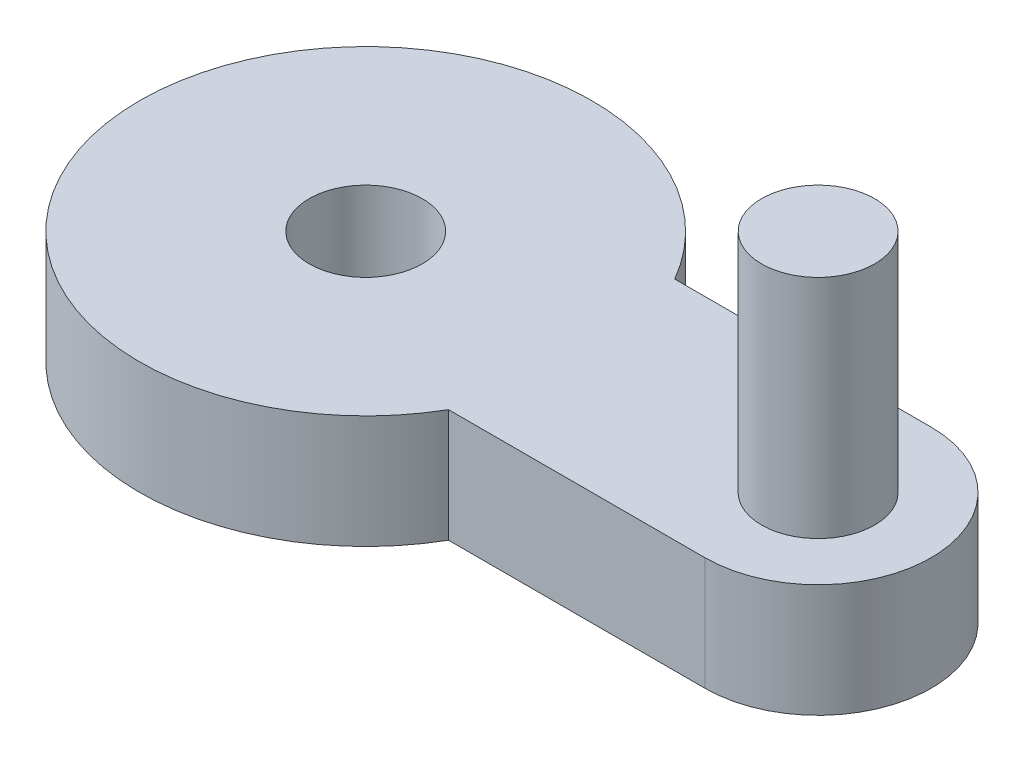
ISO-10303-21;
HEADER;
FILE_DESCRIPTION(('STEP AP214'),'2;1');
FILE_NAME('part.step','',(''),(''),'','','');
FILE_SCHEMA(('AUTOMOTIVE_DESIGN { 1 0 10303 214 1 1 1 1 }'));
ENDSEC;
DATA;
#1=APPLICATION_CONTEXT('core data for automotive mechanical design processes');
#2=APPLICATION_PROTOCOL_DEFINITION('international standard','automotive_design',2000,#1);
#3=PRODUCT_CONTEXT('',#1,'mechanical');
#4=PRODUCT('Part','Part','',(#3));
#5=PRODUCT_RELATED_PRODUCT_CATEGORY('part','',(#4));
#6=PRODUCT_DEFINITION_FORMATION('','',#4);
#7=PRODUCT_DEFINITION_CONTEXT('part definition',#1,'design');
#8=PRODUCT_DEFINITION('design','',#6,#7);
#9=PRODUCT_DEFINITION_SHAPE('','',#8);
#10=(LENGTH_UNIT() NAMED_UNIT(*) SI_UNIT(.MILLI.,.METRE.));
#11=(NAMED_UNIT(*) PLANE_ANGLE_UNIT() SI_UNIT($,.RADIAN.));
#12=(NAMED_UNIT(*) SI_UNIT($,.STERADIAN.) SOLID_ANGLE_UNIT());
#13=UNCERTAINTY_MEASURE_WITH_UNIT(LENGTH_MEASURE(1.E-05),#10,'distance_accuracy_value','');
#14=(GEOMETRIC_REPRESENTATION_CONTEXT(3) GLOBAL_UNCERTAINTY_ASSIGNED_CONTEXT((#13)) GLOBAL_UNIT_ASSIGNED_CONTEXT((#10,
#11,#12)) REPRESENTATION_CONTEXT('',''));
#15=CARTESIAN_POINT('',(0.,0.,0.));
#16=DIRECTION('',(0.,0.,1.));
#17=DIRECTION('',(1.,0.,0.));
#18=AXIS2_PLACEMENT_3D('',#15,#16,#17);
#19=CARTESIAN_POINT('',(0.,5.,0.));
#20=DIRECTION('',(0.,1.,0.));
#21=DIRECTION('',(0.,0.,1.));
#22=AXIS2_PLACEMENT_3D('',#19,#20,#21);
#23=PLANE('',#22);
#24=CARTESIAN_POINT('',(20.,5.,0.));
#25=DIRECTION('',(0.,1.,0.));
#26=DIRECTION('',(0.,0.,1.));
#27=AXIS2_PLACEMENT_3D('',#24,#25,#26);
#28=CIRCLE('',#27,2.49999999999999);
#29=CARTESIAN_POINT('',(20.,5.,2.5));
#30=VERTEX_POINT('',#29);
#31=EDGE_CURVE('E119',#30,#30,#28,.T.);
#32=ORIENTED_EDGE('',*,*,#31,.F.);
#33=EDGE_LOOP('',(#32));
#34=FACE_BOUND('',#33,.T.);
#35=CARTESIAN_POINT('',(0.,5.,0.));
#36=DIRECTION('',(0.,1.,0.));
#37=DIRECTION('',(0.,0.,1.));
#38=AXIS2_PLACEMENT_3D('',#35,#36,#37);
#39=CIRCLE('',#38,10.);
#40=CARTESIAN_POINT('',(8.66025403784439,5.,-5.));
#41=VERTEX_POINT('',#40);
#42=CARTESIAN_POINT('',(8.66025403784439,5.,5.));
#43=VERTEX_POINT('',#42);
#44=EDGE_CURVE('E86',#41,#43,#39,.T.);
#45=ORIENTED_EDGE('',*,*,#44,.T.);
#46=DIRECTION('',(1.,0.,0.));
#47=VECTOR('',#46,1.);
#48=CARTESIAN_POINT('',(20.,5.,5.));
#49=LINE('',#48,#47);
#50=CARTESIAN_POINT('',(20.,5.,5.));
#51=VERTEX_POINT('',#50);
#52=EDGE_CURVE('E81',#43,#51,#49,.T.);
#53=ORIENTED_EDGE('',*,*,#52,.T.);
#54=CARTESIAN_POINT('',(20.,5.,0.));
#55=DIRECTION('',(0.,1.,0.));
#56=DIRECTION('',(0.,0.,-1.));
#57=AXIS2_PLACEMENT_3D('',#54,#55,#56);
#58=CIRCLE('',#57,5.);
#59=CARTESIAN_POINT('',(20.,5.,-4.99999999999999));
#60=VERTEX_POINT('',#59);
#61=EDGE_CURVE('E84',#51,#60,#58,.T.);
#62=ORIENTED_EDGE('',*,*,#61,.T.);
#63=DIRECTION('',(-1.,0.,0.));
#64=VECTOR('',#63,1.);
#65=CARTESIAN_POINT('',(8.66025403784439,5.,-5.));
#66=LINE('',#65,#64);
#67=EDGE_CURVE('E51',#60,#41,#66,.T.);
#68=ORIENTED_EDGE('',*,*,#67,.T.);
#69=EDGE_LOOP('',(#45,#53,#62,#68));
#70=FACE_BOUND('',#69,.T.);
#71=CARTESIAN_POINT('',(0.,5.,0.));
#72=DIRECTION('',(0.,1.,0.));
#73=DIRECTION('',(0.,0.,1.));
#74=AXIS2_PLACEMENT_3D('',#71,#72,#73);
#75=CIRCLE('',#74,2.5);
#76=CARTESIAN_POINT('',(0.,5.,2.5));
#77=VERTEX_POINT('',#76);
#78=EDGE_CURVE('E101',#77,#77,#75,.T.);
#79=ORIENTED_EDGE('',*,*,#78,.F.);
#80=EDGE_LOOP('',(#79));
#81=FACE_BOUND('',#80,.T.);
#82=ADVANCED_FACE('F34',(#34,#70,#81),#23,.T.);
#83=CARTESIAN_POINT('',(0.,0.,0.));
#84=DIRECTION('',(0.,1.,0.));
#85=DIRECTION('',(0.,0.,1.));
#86=AXIS2_PLACEMENT_3D('',#83,#84,#85);
#87=PLANE('',#86);
#88=CARTESIAN_POINT('',(0.,0.,0.));
#89=DIRECTION('',(0.,1.,0.));
#90=DIRECTION('',(0.,0.,1.));
#91=AXIS2_PLACEMENT_3D('',#88,#89,#90);
#92=CIRCLE('',#91,10.);
#93=CARTESIAN_POINT('',(8.66025403784439,0.,-5.));
#94=VERTEX_POINT('',#93);
#95=CARTESIAN_POINT('',(8.66025403784439,0.,5.));
#96=VERTEX_POINT('',#95);
#97=EDGE_CURVE('E98',#94,#96,#92,.T.);
#98=ORIENTED_EDGE('',*,*,#97,.F.);
#99=DIRECTION('',(-1.,0.,0.));
#100=VECTOR('',#99,1.);
#101=CARTESIAN_POINT('',(8.66025403784439,0.,-5.));
#102=LINE('',#101,#100);
#103=CARTESIAN_POINT('',(20.,0.,-4.99999999999999));
#104=VERTEX_POINT('',#103);
#105=EDGE_CURVE('E74',#104,#94,#102,.T.);
#106=ORIENTED_EDGE('',*,*,#105,.F.);
#107=CARTESIAN_POINT('',(20.,0.,0.));
#108=DIRECTION('',(0.,1.,0.));
#109=DIRECTION('',(0.,0.,-1.));
#110=AXIS2_PLACEMENT_3D('',#107,#108,#109);
#111=CIRCLE('',#110,5.);
#112=CARTESIAN_POINT('',(20.,0.,5.));
#113=VERTEX_POINT('',#112);
#114=EDGE_CURVE('E68',#113,#104,#111,.T.);
#115=ORIENTED_EDGE('',*,*,#114,.F.);
#116=DIRECTION('',(1.,0.,0.));
#117=VECTOR('',#116,1.);
#118=CARTESIAN_POINT('',(20.,0.,5.));
#119=LINE('',#118,#117);
#120=EDGE_CURVE('E90',#96,#113,#119,.T.);
#121=ORIENTED_EDGE('',*,*,#120,.F.);
#122=EDGE_LOOP('',(#98,#106,#115,#121));
#123=FACE_BOUND('',#122,.T.);
#124=CARTESIAN_POINT('',(0.,0.,0.));
#125=DIRECTION('',(0.,1.,0.));
#126=DIRECTION('',(0.,0.,1.));
#127=AXIS2_PLACEMENT_3D('',#124,#125,#126);
#128=CIRCLE('',#127,2.5);
#129=CARTESIAN_POINT('',(0.,0.,2.5));
#130=VERTEX_POINT('',#129);
#131=EDGE_CURVE('E113',#130,#130,#128,.T.);
#132=ORIENTED_EDGE('',*,*,#131,.T.);
#133=EDGE_LOOP('',(#132));
#134=FACE_BOUND('',#133,.T.);
#135=ADVANCED_FACE('F109',(#123,#134),#87,.F.);
#136=CARTESIAN_POINT('',(0.,5.,0.));
#137=DIRECTION('',(0.,-1.,0.));
#138=DIRECTION('',(0.,0.,-1.));
#139=AXIS2_PLACEMENT_3D('',#136,#137,#138);
#140=CYLINDRICAL_SURFACE('',#139,10.);
#141=ORIENTED_EDGE('',*,*,#97,.T.);
#142=DIRECTION('',(0.,-1.,0.));
#143=VECTOR('',#142,1.);
#144=CARTESIAN_POINT('',(8.66025403784439,5.,5.));
#145=LINE('',#144,#143);
#146=EDGE_CURVE('E11',#43,#96,#145,.T.);
#147=ORIENTED_EDGE('',*,*,#146,.F.);
#148=ORIENTED_EDGE('',*,*,#44,.F.);
#149=DIRECTION('',(0.,-1.,0.));
#150=VECTOR('',#149,1.);
#151=CARTESIAN_POINT('',(8.66025403784439,5.,-5.));
#152=LINE('',#151,#150);
#153=EDGE_CURVE('E94',#41,#94,#152,.T.);
#154=ORIENTED_EDGE('',*,*,#153,.T.);
#155=EDGE_LOOP('',(#141,#147,#148,#154));
#156=FACE_BOUND('',#155,.T.);
#157=ADVANCED_FACE('F36',(#156),#140,.T.);
#158=CARTESIAN_POINT('',(20.,5.,5.));
#159=DIRECTION('',(0.,0.,-1.));
#160=DIRECTION('',(-1.,0.,0.));
#161=AXIS2_PLACEMENT_3D('',#158,#159,#160);
#162=PLANE('',#161);
#163=ORIENTED_EDGE('',*,*,#120,.T.);
#164=DIRECTION('',(0.,-1.,0.));
#165=VECTOR('',#164,1.);
#166=CARTESIAN_POINT('',(20.,5.,5.));
#167=LINE('',#166,#165);
#168=EDGE_CURVE('E43',#51,#113,#167,.T.);
#169=ORIENTED_EDGE('',*,*,#168,.F.);
#170=ORIENTED_EDGE('',*,*,#52,.F.);
#171=ORIENTED_EDGE('',*,*,#146,.T.);
#172=EDGE_LOOP('',(#163,#169,#170,#171));
#173=FACE_BOUND('',#172,.T.);
#174=ADVANCED_FACE('F89',(#173),#162,.F.);
#175=CARTESIAN_POINT('',(20.,5.,0.));
#176=DIRECTION('',(0.,-1.,0.));
#177=DIRECTION('',(0.,0.,-1.));
#178=AXIS2_PLACEMENT_3D('',#175,#176,#177);
#179=CYLINDRICAL_SURFACE('',#178,5.);
#180=ORIENTED_EDGE('',*,*,#114,.T.);
#181=DIRECTION('',(0.,-1.,0.));
#182=VECTOR('',#181,1.);
#183=CARTESIAN_POINT('',(20.,5.,-4.99999999999999));
#184=LINE('',#183,#182);
#185=EDGE_CURVE('E91',#60,#104,#184,.T.);
#186=ORIENTED_EDGE('',*,*,#185,.F.);
#187=ORIENTED_EDGE('',*,*,#61,.F.);
#188=ORIENTED_EDGE('',*,*,#168,.T.);
#189=EDGE_LOOP('',(#180,#186,#187,#188));
#190=FACE_BOUND('',#189,.T.);
#191=ADVANCED_FACE('F92',(#190),#179,.T.);
#192=CARTESIAN_POINT('',(8.66025403784439,5.,-5.));
#193=DIRECTION('',(0.,0.,1.));
#194=DIRECTION('',(1.,0.,0.));
#195=AXIS2_PLACEMENT_3D('',#192,#193,#194);
#196=PLANE('',#195);
#197=ORIENTED_EDGE('',*,*,#105,.T.);
#198=ORIENTED_EDGE('',*,*,#153,.F.);
#199=ORIENTED_EDGE('',*,*,#67,.F.);
#200=ORIENTED_EDGE('',*,*,#185,.T.);
#201=EDGE_LOOP('',(#197,#198,#199,#200));
#202=FACE_BOUND('',#201,.T.);
#203=ADVANCED_FACE('F106',(#202),#196,.F.);
#204=CARTESIAN_POINT('',(0.,5.,0.));
#205=DIRECTION('',(0.,-1.,0.));
#206=DIRECTION('',(0.,0.,-1.));
#207=AXIS2_PLACEMENT_3D('',#204,#205,#206);
#208=CYLINDRICAL_SURFACE('',#207,2.5);
#209=ORIENTED_EDGE('',*,*,#78,.T.);
#210=EDGE_LOOP('',(#209));
#211=FACE_BOUND('',#210,.T.);
#212=ORIENTED_EDGE('',*,*,#131,.F.);
#213=EDGE_LOOP('',(#212));
#214=FACE_BOUND('',#213,.T.);
#215=ADVANCED_FACE('F130',(#211,#214),#208,.F.);
#216=CARTESIAN_POINT('',(20.,15.,0.));
#217=DIRECTION('',(0.,-1.,0.));
#218=DIRECTION('',(0.,0.,-1.));
#219=AXIS2_PLACEMENT_3D('',#216,#217,#218);
#220=CYLINDRICAL_SURFACE('',#219,2.49999999999999);
#221=CARTESIAN_POINT('',(20.,15.,0.));
#222=DIRECTION('',(0.,1.,0.));
#223=DIRECTION('',(0.,0.,1.));
#224=AXIS2_PLACEMENT_3D('',#221,#222,#223);
#225=CIRCLE('',#224,2.49999999999999);
#226=CARTESIAN_POINT('',(20.,15.,2.5));
#227=VERTEX_POINT('',#226);
#228=EDGE_CURVE('E116',#227,#227,#225,.T.);
#229=ORIENTED_EDGE('',*,*,#228,.F.);
#230=EDGE_LOOP('',(#229));
#231=FACE_BOUND('',#230,.T.);
#232=ORIENTED_EDGE('',*,*,#31,.T.);
#233=EDGE_LOOP('',(#232));
#234=FACE_BOUND('',#233,.T.);
#235=ADVANCED_FACE('F127',(#231,#234),#220,.T.);
#236=CARTESIAN_POINT('',(20.,15.,0.));
#237=DIRECTION('',(0.,1.,0.));
#238=DIRECTION('',(0.,0.,1.));
#239=AXIS2_PLACEMENT_3D('',#236,#237,#238);
#240=PLANE('',#239);
#241=ORIENTED_EDGE('',*,*,#228,.T.);
#242=EDGE_LOOP('',(#241));
#243=FACE_BOUND('',#242,.T.);
#244=ADVANCED_FACE('F125',(#243),#240,.T.);
#245=CLOSED_SHELL('',(#82,#135,#157,#174,#191,#203,#215,#235,#244));
#246=MANIFOLD_SOLID_BREP('B2',#245);
#247=ADVANCED_BREP_SHAPE_REPRESENTATION('',(#18,#246),#14);
#248=SHAPE_DEFINITION_REPRESENTATION(#9,#247);
ENDSEC;
END-ISO-10303-21;
